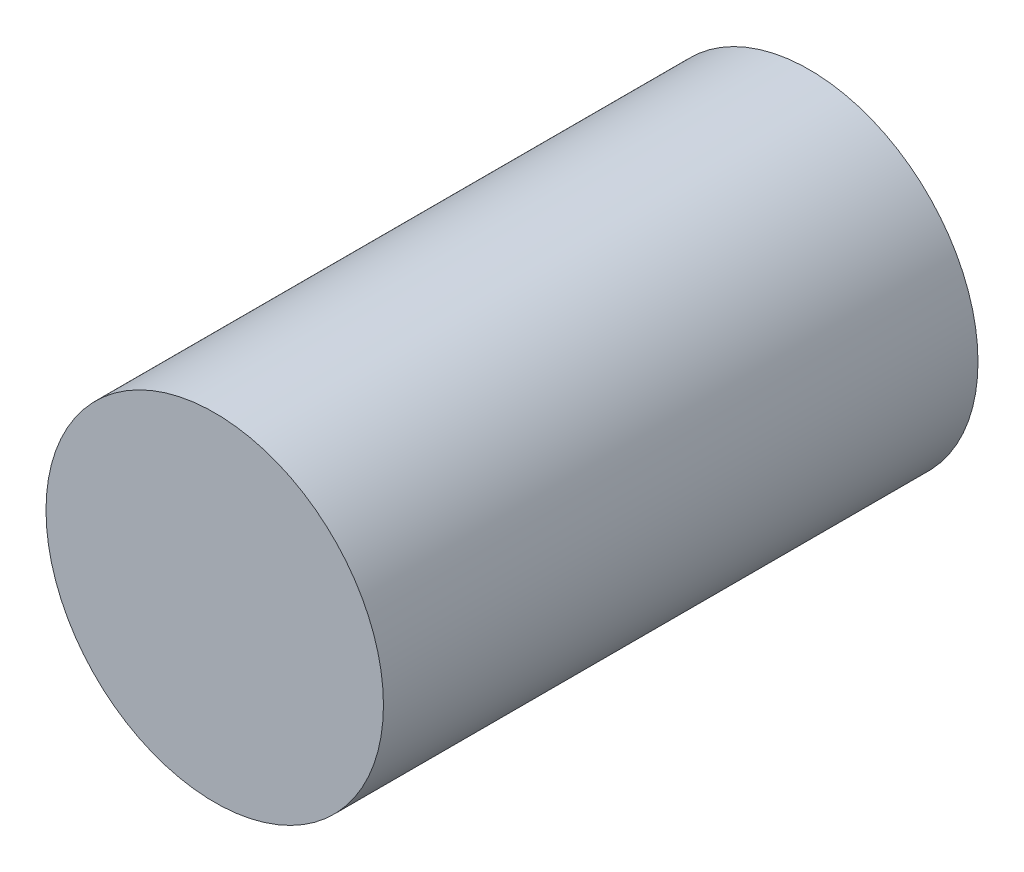
ISO-10303-21;
HEADER;
FILE_DESCRIPTION(('STEP AP214'),'2;1');
FILE_NAME('part.step','',(''),(''),'','','');
FILE_SCHEMA(('AUTOMOTIVE_DESIGN { 1 0 10303 214 1 1 1 1 }'));
ENDSEC;
DATA;
#1=APPLICATION_CONTEXT('core data for automotive mechanical design processes');
#2=APPLICATION_PROTOCOL_DEFINITION('international standard','automotive_design',2000,#1);
#3=PRODUCT_CONTEXT('',#1,'mechanical');
#4=PRODUCT('Part','Part','',(#3));
#5=PRODUCT_RELATED_PRODUCT_CATEGORY('part','',(#4));
#6=PRODUCT_DEFINITION_FORMATION('','',#4);
#7=PRODUCT_DEFINITION_CONTEXT('part definition',#1,'design');
#8=PRODUCT_DEFINITION('design','',#6,#7);
#9=PRODUCT_DEFINITION_SHAPE('','',#8);
#10=(LENGTH_UNIT() NAMED_UNIT(*) SI_UNIT(.MILLI.,.METRE.));
#11=(NAMED_UNIT(*) PLANE_ANGLE_UNIT() SI_UNIT($,.RADIAN.));
#12=(NAMED_UNIT(*) SI_UNIT($,.STERADIAN.) SOLID_ANGLE_UNIT());
#13=UNCERTAINTY_MEASURE_WITH_UNIT(LENGTH_MEASURE(1.E-05),#10,'distance_accuracy_value','');
#14=(GEOMETRIC_REPRESENTATION_CONTEXT(3) GLOBAL_UNCERTAINTY_ASSIGNED_CONTEXT((#13)) GLOBAL_UNIT_ASSIGNED_CONTEXT((#10,
#11,#12)) REPRESENTATION_CONTEXT('',''));
#15=CARTESIAN_POINT('',(0.,0.,0.));
#16=DIRECTION('',(0.,0.,1.));
#17=DIRECTION('',(1.,0.,0.));
#18=AXIS2_PLACEMENT_3D('',#15,#16,#17);
#19=CARTESIAN_POINT('',(0.,0.,74.));
#20=DIRECTION('',(0.,0.,-1.));
#21=DIRECTION('',(-1.,0.,0.));
#22=AXIS2_PLACEMENT_3D('',#19,#20,#21);
#23=CYLINDRICAL_SURFACE('',#22,21.);
#24=CARTESIAN_POINT('',(0.,0.,74.));
#25=DIRECTION('',(0.,0.,1.));
#26=DIRECTION('',(1.,0.,0.));
#27=AXIS2_PLACEMENT_3D('',#24,#25,#26);
#28=CIRCLE('',#27,21.);
#29=CARTESIAN_POINT('',(21.,0.,74.));
#30=VERTEX_POINT('',#29);
#31=EDGE_CURVE('E10',#30,#30,#28,.T.);
#32=ORIENTED_EDGE('',*,*,#31,.F.);
#33=EDGE_LOOP('',(#32));
#34=FACE_BOUND('',#33,.T.);
#35=CARTESIAN_POINT('',(0.,0.,0.));
#36=DIRECTION('',(0.,0.,1.));
#37=DIRECTION('',(1.,0.,0.));
#38=AXIS2_PLACEMENT_3D('',#35,#36,#37);
#39=CIRCLE('',#38,21.);
#40=CARTESIAN_POINT('',(21.,0.,0.));
#41=VERTEX_POINT('',#40);
#42=EDGE_CURVE('E33',#41,#41,#39,.T.);
#43=ORIENTED_EDGE('',*,*,#42,.T.);
#44=EDGE_LOOP('',(#43));
#45=FACE_BOUND('',#44,.T.);
#46=ADVANCED_FACE('F30',(#34,#45),#23,.T.);
#47=CARTESIAN_POINT('',(0.,0.,74.));
#48=DIRECTION('',(0.,0.,1.));
#49=DIRECTION('',(1.,0.,0.));
#50=AXIS2_PLACEMENT_3D('',#47,#48,#49);
#51=PLANE('',#50);
#52=ORIENTED_EDGE('',*,*,#31,.T.);
#53=EDGE_LOOP('',(#52));
#54=FACE_BOUND('',#53,.T.);
#55=ADVANCED_FACE('F45',(#54),#51,.T.);
#56=CARTESIAN_POINT('',(0.,0.,0.));
#57=DIRECTION('',(0.,0.,1.));
#58=DIRECTION('',(1.,0.,0.));
#59=AXIS2_PLACEMENT_3D('',#56,#57,#58);
#60=PLANE('',#59);
#61=ORIENTED_EDGE('',*,*,#42,.F.);
#62=EDGE_LOOP('',(#61));
#63=FACE_BOUND('',#62,.T.);
#64=ADVANCED_FACE('F43',(#63),#60,.F.);
#65=CLOSED_SHELL('',(#46,#55,#64));
#66=MANIFOLD_SOLID_BREP('B2',#65);
#67=ADVANCED_BREP_SHAPE_REPRESENTATION('',(#18,#66),#14);
#68=SHAPE_DEFINITION_REPRESENTATION(#9,#67);
ENDSEC;
END-ISO-10303-21;
